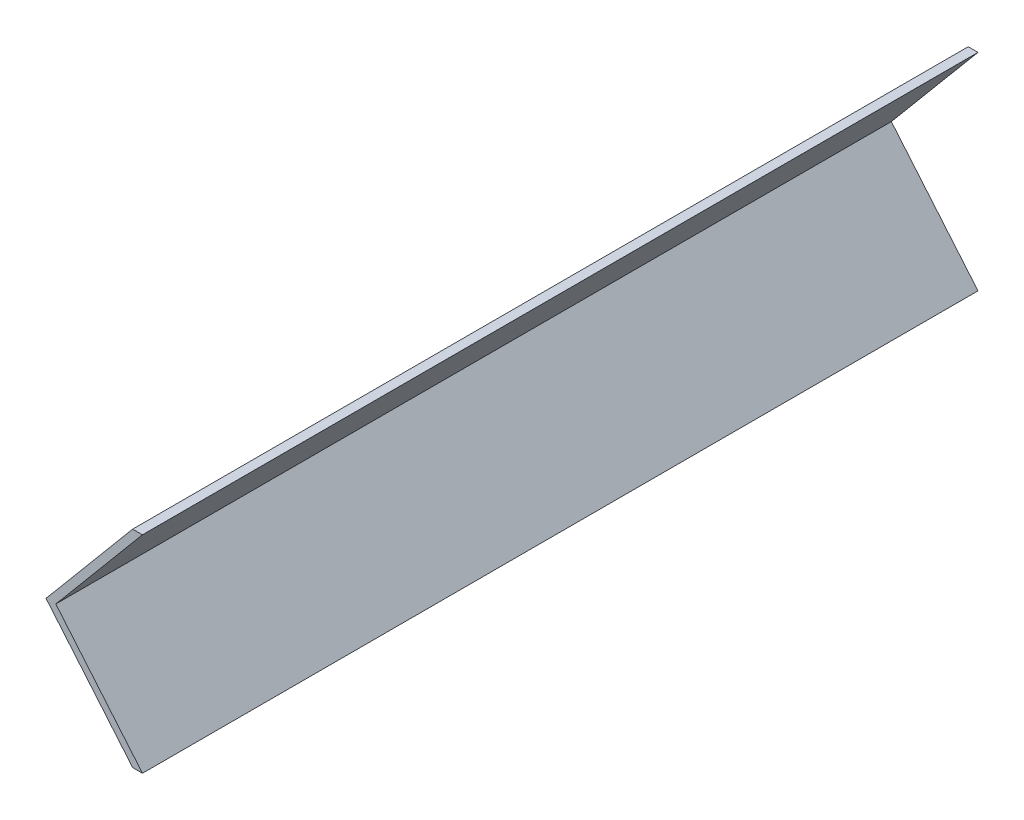
ISO-10303-21;
HEADER;
FILE_DESCRIPTION(('STEP AP214'),'2;1');
FILE_NAME('part.step','',(''),(''),'','','');
FILE_SCHEMA(('AUTOMOTIVE_DESIGN { 1 0 10303 214 1 1 1 1 }'));
ENDSEC;
DATA;
#1=APPLICATION_CONTEXT('core data for automotive mechanical design processes');
#2=APPLICATION_PROTOCOL_DEFINITION('international standard','automotive_design',2000,#1);
#3=PRODUCT_CONTEXT('',#1,'mechanical');
#4=PRODUCT('Part','Part','',(#3));
#5=PRODUCT_RELATED_PRODUCT_CATEGORY('part','',(#4));
#6=PRODUCT_DEFINITION_FORMATION('','',#4);
#7=PRODUCT_DEFINITION_CONTEXT('part definition',#1,'design');
#8=PRODUCT_DEFINITION('design','',#6,#7);
#9=PRODUCT_DEFINITION_SHAPE('','',#8);
#10=(LENGTH_UNIT() NAMED_UNIT(*) SI_UNIT(.MILLI.,.METRE.));
#11=(NAMED_UNIT(*) PLANE_ANGLE_UNIT() SI_UNIT($,.RADIAN.));
#12=(NAMED_UNIT(*) SI_UNIT($,.STERADIAN.) SOLID_ANGLE_UNIT());
#13=UNCERTAINTY_MEASURE_WITH_UNIT(LENGTH_MEASURE(1.E-05),#10,'distance_accuracy_value','');
#14=(GEOMETRIC_REPRESENTATION_CONTEXT(3) GLOBAL_UNCERTAINTY_ASSIGNED_CONTEXT((#13)) GLOBAL_UNIT_ASSIGNED_CONTEXT((#10,
#11,#12)) REPRESENTATION_CONTEXT('',''));
#15=CARTESIAN_POINT('',(0.,0.,0.));
#16=DIRECTION('',(0.,0.,1.));
#17=DIRECTION('',(1.,0.,0.));
#18=AXIS2_PLACEMENT_3D('',#15,#16,#17);
#19=CARTESIAN_POINT('',(0.,0.,222.5));
#20=DIRECTION('',(0.,-1.,0.));
#21=DIRECTION('',(0.,0.,-1.));
#22=AXIS2_PLACEMENT_3D('',#19,#20,#21);
#23=PLANE('',#22);
#24=DIRECTION('',(-1.,0.,0.));
#25=VECTOR('',#24,1.);
#26=CARTESIAN_POINT('',(0.,0.,0.));
#27=LINE('',#26,#25);
#28=CARTESIAN_POINT('',(2.61081457866456,0.,0.));
#29=VERTEX_POINT('',#28);
#30=CARTESIAN_POINT('',(0.,0.,0.));
#31=VERTEX_POINT('',#30);
#32=EDGE_CURVE('E118',#29,#31,#27,.T.);
#33=ORIENTED_EDGE('',*,*,#32,.T.);
#34=DIRECTION('',(0.,0.,-1.));
#35=VECTOR('',#34,1.);
#36=CARTESIAN_POINT('',(0.,0.,222.5));
#37=LINE('',#36,#35);
#38=CARTESIAN_POINT('',(0.,0.,222.5));
#39=VERTEX_POINT('',#38);
#40=EDGE_CURVE('E11',#39,#31,#37,.T.);
#41=ORIENTED_EDGE('',*,*,#40,.F.);
#42=DIRECTION('',(-1.,0.,0.));
#43=VECTOR('',#42,1.);
#44=CARTESIAN_POINT('',(0.,0.,222.5));
#45=LINE('',#44,#43);
#46=CARTESIAN_POINT('',(2.61081457866456,0.,222.5));
#47=VERTEX_POINT('',#46);
#48=EDGE_CURVE('E128',#47,#39,#45,.T.);
#49=ORIENTED_EDGE('',*,*,#48,.F.);
#50=DIRECTION('',(0.,0.,-1.));
#51=VECTOR('',#50,1.);
#52=CARTESIAN_POINT('',(2.61081457866456,0.,222.5));
#53=LINE('',#52,#51);
#54=EDGE_CURVE('E114',#47,#29,#53,.T.);
#55=ORIENTED_EDGE('',*,*,#54,.T.);
#56=EDGE_LOOP('',(#33,#41,#49,#55));
#57=FACE_BOUND('',#56,.T.);
#58=ADVANCED_FACE('F34',(#57),#23,.F.);
#59=CARTESIAN_POINT('',(0.,0.,222.5));
#60=DIRECTION('',(0.766044443118977,-0.64278760968654,0.));
#61=DIRECTION('',(0.64278760968654,0.766044443118977,0.));
#62=AXIS2_PLACEMENT_3D('',#59,#60,#61);
#63=PLANE('',#62);
#64=DIRECTION('',(-0.64278760968654,-0.766044443118977,0.));
#65=VECTOR('',#64,1.);
#66=CARTESIAN_POINT('',(0.,0.,0.));
#67=LINE('',#66,#65);
#68=CARTESIAN_POINT('',(-23.0752398573753,-27.5,0.));
#69=VERTEX_POINT('',#68);
#70=EDGE_CURVE('E121',#31,#69,#67,.T.);
#71=ORIENTED_EDGE('',*,*,#70,.T.);
#72=DIRECTION('',(0.,0.,-1.));
#73=VECTOR('',#72,1.);
#74=CARTESIAN_POINT('',(-23.0752398573753,-27.5,222.5));
#75=LINE('',#74,#73);
#76=CARTESIAN_POINT('',(-23.0752398573753,-27.5,222.5));
#77=VERTEX_POINT('',#76);
#78=EDGE_CURVE('E42',#77,#69,#75,.T.);
#79=ORIENTED_EDGE('',*,*,#78,.F.);
#80=DIRECTION('',(-0.64278760968654,-0.766044443118977,0.));
#81=VECTOR('',#80,1.);
#82=CARTESIAN_POINT('',(0.,0.,222.5));
#83=LINE('',#82,#81);
#84=EDGE_CURVE('E87',#39,#77,#83,.T.);
#85=ORIENTED_EDGE('',*,*,#84,.F.);
#86=ORIENTED_EDGE('',*,*,#40,.T.);
#87=EDGE_LOOP('',(#71,#79,#85,#86));
#88=FACE_BOUND('',#87,.T.);
#89=ADVANCED_FACE('F152',(#88),#63,.F.);
#90=CARTESIAN_POINT('',(-23.0752398573753,-27.5,222.5));
#91=DIRECTION('',(0.766044443118977,0.642787609686541,0.));
#92=DIRECTION('',(-0.642787609686541,0.766044443118977,0.));
#93=AXIS2_PLACEMENT_3D('',#90,#91,#92);
#94=PLANE('',#93);
#95=DIRECTION('',(0.642787609686541,-0.766044443118977,0.));
#96=VECTOR('',#95,1.);
#97=CARTESIAN_POINT('',(-23.0752398573753,-27.5,0.));
#98=LINE('',#97,#96);
#99=CARTESIAN_POINT('',(0.,-55.,0.));
#100=VERTEX_POINT('',#99);
#101=EDGE_CURVE('E123',#69,#100,#98,.T.);
#102=ORIENTED_EDGE('',*,*,#101,.T.);
#103=DIRECTION('',(0.,0.,-1.));
#104=VECTOR('',#103,1.);
#105=CARTESIAN_POINT('',(0.,-55.,222.5));
#106=LINE('',#105,#104);
#107=CARTESIAN_POINT('',(0.,-55.,222.5));
#108=VERTEX_POINT('',#107);
#109=EDGE_CURVE('E109',#108,#100,#106,.T.);
#110=ORIENTED_EDGE('',*,*,#109,.F.);
#111=DIRECTION('',(0.642787609686541,-0.766044443118977,0.));
#112=VECTOR('',#111,1.);
#113=CARTESIAN_POINT('',(-23.0752398573753,-27.5,222.5));
#114=LINE('',#113,#112);
#115=EDGE_CURVE('E100',#77,#108,#114,.T.);
#116=ORIENTED_EDGE('',*,*,#115,.F.);
#117=ORIENTED_EDGE('',*,*,#78,.T.);
#118=EDGE_LOOP('',(#102,#110,#116,#117));
#119=FACE_BOUND('',#118,.T.);
#120=ADVANCED_FACE('F134',(#119),#94,.F.);
#121=CARTESIAN_POINT('',(0.,-55.,222.5));
#122=DIRECTION('',(0.,1.,0.));
#123=DIRECTION('',(0.,0.,1.));
#124=AXIS2_PLACEMENT_3D('',#121,#122,#123);
#125=PLANE('',#124);
#126=DIRECTION('',(1.,0.,0.));
#127=VECTOR('',#126,1.);
#128=CARTESIAN_POINT('',(0.,-55.,0.));
#129=LINE('',#128,#127);
#130=CARTESIAN_POINT('',(2.61081457866456,-55.,0.));
#131=VERTEX_POINT('',#130);
#132=EDGE_CURVE('E108',#100,#131,#129,.T.);
#133=ORIENTED_EDGE('',*,*,#132,.T.);
#134=DIRECTION('',(0.,0.,-1.));
#135=VECTOR('',#134,1.);
#136=CARTESIAN_POINT('',(2.61081457866456,-55.,222.5));
#137=LINE('',#136,#135);
#138=CARTESIAN_POINT('',(2.61081457866456,-55.,222.5));
#139=VERTEX_POINT('',#138);
#140=EDGE_CURVE('E105',#139,#131,#137,.T.);
#141=ORIENTED_EDGE('',*,*,#140,.F.);
#142=DIRECTION('',(1.,0.,0.));
#143=VECTOR('',#142,1.);
#144=CARTESIAN_POINT('',(0.,-55.,222.5));
#145=LINE('',#144,#143);
#146=EDGE_CURVE('E94',#108,#139,#145,.T.);
#147=ORIENTED_EDGE('',*,*,#146,.F.);
#148=ORIENTED_EDGE('',*,*,#109,.T.);
#149=EDGE_LOOP('',(#133,#141,#147,#148));
#150=FACE_BOUND('',#149,.T.);
#151=ADVANCED_FACE('F106',(#150),#125,.F.);
#152=CARTESIAN_POINT('',(-20.4644252787107,-27.5,222.5));
#153=DIRECTION('',(-0.766044443118977,-0.64278760968654,0.));
#154=DIRECTION('',(0.64278760968654,-0.766044443118977,0.));
#155=AXIS2_PLACEMENT_3D('',#152,#153,#154);
#156=PLANE('',#155);
#157=DIRECTION('',(-0.64278760968654,0.766044443118977,0.));
#158=VECTOR('',#157,1.);
#159=CARTESIAN_POINT('',(-20.4644252787107,-27.5,0.));
#160=LINE('',#159,#158);
#161=CARTESIAN_POINT('',(-20.4644252787107,-27.5,0.));
#162=VERTEX_POINT('',#161);
#163=EDGE_CURVE('E73',#131,#162,#160,.T.);
#164=ORIENTED_EDGE('',*,*,#163,.T.);
#165=DIRECTION('',(0.,0.,-1.));
#166=VECTOR('',#165,1.);
#167=CARTESIAN_POINT('',(-20.4644252787107,-27.5,222.5));
#168=LINE('',#167,#166);
#169=CARTESIAN_POINT('',(-20.4644252787107,-27.5,222.5));
#170=VERTEX_POINT('',#169);
#171=EDGE_CURVE('E110',#170,#162,#168,.T.);
#172=ORIENTED_EDGE('',*,*,#171,.F.);
#173=DIRECTION('',(-0.64278760968654,0.766044443118977,0.));
#174=VECTOR('',#173,1.);
#175=CARTESIAN_POINT('',(-20.4644252787107,-27.5,222.5));
#176=LINE('',#175,#174);
#177=EDGE_CURVE('E98',#139,#170,#176,.T.);
#178=ORIENTED_EDGE('',*,*,#177,.F.);
#179=ORIENTED_EDGE('',*,*,#140,.T.);
#180=EDGE_LOOP('',(#164,#172,#178,#179));
#181=FACE_BOUND('',#180,.T.);
#182=ADVANCED_FACE('F112',(#181),#156,.F.);
#183=CARTESIAN_POINT('',(2.61081457866456,0.,222.5));
#184=DIRECTION('',(-0.766044443118977,0.64278760968654,0.));
#185=DIRECTION('',(-0.64278760968654,-0.766044443118977,0.));
#186=AXIS2_PLACEMENT_3D('',#183,#184,#185);
#187=PLANE('',#186);
#188=DIRECTION('',(0.64278760968654,0.766044443118977,0.));
#189=VECTOR('',#188,1.);
#190=CARTESIAN_POINT('',(2.61081457866456,0.,0.));
#191=LINE('',#190,#189);
#192=EDGE_CURVE('E79',#162,#29,#191,.T.);
#193=ORIENTED_EDGE('',*,*,#192,.T.);
#194=ORIENTED_EDGE('',*,*,#54,.F.);
#195=DIRECTION('',(0.64278760968654,0.766044443118977,0.));
#196=VECTOR('',#195,1.);
#197=CARTESIAN_POINT('',(2.61081457866456,0.,222.5));
#198=LINE('',#197,#196);
#199=EDGE_CURVE('E50',#170,#47,#198,.T.);
#200=ORIENTED_EDGE('',*,*,#199,.F.);
#201=ORIENTED_EDGE('',*,*,#171,.T.);
#202=EDGE_LOOP('',(#193,#194,#200,#201));
#203=FACE_BOUND('',#202,.T.);
#204=ADVANCED_FACE('F141',(#203),#187,.F.);
#205=CARTESIAN_POINT('',(0.,0.,222.5));
#206=DIRECTION('',(0.,0.,-1.));
#207=DIRECTION('',(-1.,0.,0.));
#208=AXIS2_PLACEMENT_3D('',#205,#206,#207);
#209=PLANE('',#208);
#210=ORIENTED_EDGE('',*,*,#48,.T.);
#211=ORIENTED_EDGE('',*,*,#84,.T.);
#212=ORIENTED_EDGE('',*,*,#115,.T.);
#213=ORIENTED_EDGE('',*,*,#146,.T.);
#214=ORIENTED_EDGE('',*,*,#177,.T.);
#215=ORIENTED_EDGE('',*,*,#199,.T.);
#216=EDGE_LOOP('',(#210,#211,#212,#213,#214,#215));
#217=FACE_BOUND('',#216,.T.);
#218=ADVANCED_FACE('F96',(#217),#209,.F.);
#219=CARTESIAN_POINT('',(0.,0.,0.));
#220=DIRECTION('',(0.,0.,-1.));
#221=DIRECTION('',(-1.,0.,0.));
#222=AXIS2_PLACEMENT_3D('',#219,#220,#221);
#223=PLANE('',#222);
#224=ORIENTED_EDGE('',*,*,#32,.F.);
#225=ORIENTED_EDGE('',*,*,#192,.F.);
#226=ORIENTED_EDGE('',*,*,#163,.F.);
#227=ORIENTED_EDGE('',*,*,#132,.F.);
#228=ORIENTED_EDGE('',*,*,#101,.F.);
#229=ORIENTED_EDGE('',*,*,#70,.F.);
#230=EDGE_LOOP('',(#224,#225,#226,#227,#228,#229));
#231=FACE_BOUND('',#230,.T.);
#232=ADVANCED_FACE('F137',(#231),#223,.T.);
#233=CLOSED_SHELL('',(#58,#89,#120,#151,#182,#204,#218,#232));
#234=MANIFOLD_SOLID_BREP('B2',#233);
#235=ADVANCED_BREP_SHAPE_REPRESENTATION('',(#18,#234),#14);
#236=SHAPE_DEFINITION_REPRESENTATION(#9,#235);
ENDSEC;
END-ISO-10303-21;
